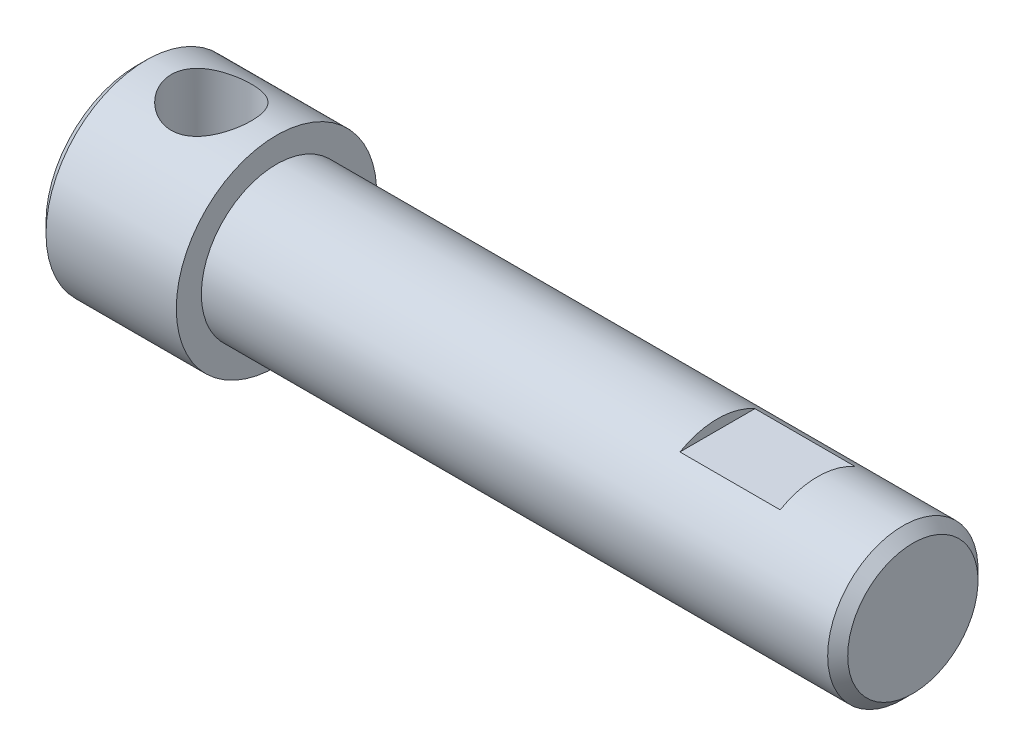
ISO-10303-21;
HEADER;
FILE_DESCRIPTION(('STEP AP214'),'2;1');
FILE_NAME('part.step','',(''),(''),'','','');
FILE_SCHEMA(('AUTOMOTIVE_DESIGN { 1 0 10303 214 1 1 1 1 }'));
ENDSEC;
DATA;
#1=APPLICATION_CONTEXT('core data for automotive mechanical design processes');
#2=APPLICATION_PROTOCOL_DEFINITION('international standard','automotive_design',2000,#1);
#3=PRODUCT_CONTEXT('',#1,'mechanical');
#4=PRODUCT('Part','Part','',(#3));
#5=PRODUCT_RELATED_PRODUCT_CATEGORY('part','',(#4));
#6=PRODUCT_DEFINITION_FORMATION('','',#4);
#7=PRODUCT_DEFINITION_CONTEXT('part definition',#1,'design');
#8=PRODUCT_DEFINITION('design','',#6,#7);
#9=PRODUCT_DEFINITION_SHAPE('','',#8);
#10=(LENGTH_UNIT() NAMED_UNIT(*) SI_UNIT(.MILLI.,.METRE.));
#11=(NAMED_UNIT(*) PLANE_ANGLE_UNIT() SI_UNIT($,.RADIAN.));
#12=(NAMED_UNIT(*) SI_UNIT($,.STERADIAN.) SOLID_ANGLE_UNIT());
#13=UNCERTAINTY_MEASURE_WITH_UNIT(LENGTH_MEASURE(1.E-05),#10,'distance_accuracy_value','');
#14=(GEOMETRIC_REPRESENTATION_CONTEXT(3) GLOBAL_UNCERTAINTY_ASSIGNED_CONTEXT((#13)) GLOBAL_UNIT_ASSIGNED_CONTEXT((#10,
#11,#12)) REPRESENTATION_CONTEXT('',''));
#15=CARTESIAN_POINT('',(0.,0.,0.));
#16=DIRECTION('',(0.,0.,1.));
#17=DIRECTION('',(1.,0.,0.));
#18=AXIS2_PLACEMENT_3D('',#15,#16,#17);
#19=CARTESIAN_POINT('',(-1000.,0.,0.));
#20=DIRECTION('',(-1.,0.,0.));
#21=DIRECTION('',(0.,0.,1.));
#22=AXIS2_PLACEMENT_3D('',#19,#20,#21);
#23=CYLINDRICAL_SURFACE('',#22,7.49999999999999);
#24=CARTESIAN_POINT('',(44.,0.,0.));
#25=DIRECTION('',(-1.,0.,0.));
#26=DIRECTION('',(0.,0.,1.));
#27=AXIS2_PLACEMENT_3D('',#24,#25,#26);
#28=CIRCLE('',#27,7.5);
#29=CARTESIAN_POINT('',(44.,0.,7.5));
#30=VERTEX_POINT('',#29);
#31=EDGE_CURVE('E189',#30,#30,#28,.T.);
#32=ORIENTED_EDGE('',*,*,#31,.T.);
#33=EDGE_LOOP('',(#32));
#34=FACE_BOUND('',#33,.T.);
#35=CARTESIAN_POINT('',(-18.5,0.,0.));
#36=DIRECTION('',(-1.,0.,0.));
#37=DIRECTION('',(0.,0.,1.));
#38=AXIS2_PLACEMENT_3D('',#35,#36,#37);
#39=CIRCLE('',#38,7.49999999999998);
#40=CARTESIAN_POINT('',(-18.5,0.,7.49999999999998));
#41=VERTEX_POINT('',#40);
#42=EDGE_CURVE('E192',#41,#41,#39,.T.);
#43=ORIENTED_EDGE('',*,*,#42,.F.);
#44=EDGE_LOOP('',(#43));
#45=FACE_BOUND('',#44,.T.);
#46=CARTESIAN_POINT('',(25.5000000000001,0.,0.));
#47=DIRECTION('',(1.,0.,0.));
#48=DIRECTION('',(0.,0.,-1.));
#49=AXIS2_PLACEMENT_3D('',#46,#47,#48);
#50=CIRCLE('',#49,7.49999999999999);
#51=CARTESIAN_POINT('',(25.5,6.49999999999999,-3.7416573867741));
#52=VERTEX_POINT('',#51);
#53=CARTESIAN_POINT('',(25.5,6.49999999999999,3.7416573867741));
#54=VERTEX_POINT('',#53);
#55=EDGE_CURVE('E11',#52,#54,#50,.T.);
#56=ORIENTED_EDGE('',*,*,#55,.F.);
#57=DIRECTION('',(-1.,0.,0.));
#58=VECTOR('',#57,1.);
#59=CARTESIAN_POINT('',(-1000.,6.4999999999999,-3.7416573867741));
#60=LINE('',#59,#58);
#61=CARTESIAN_POINT('',(35.5000000000001,6.49999999999999,-3.74165738677394));
#62=VERTEX_POINT('',#61);
#63=EDGE_CURVE('E51',#62,#52,#60,.T.);
#64=ORIENTED_EDGE('',*,*,#63,.F.);
#65=CARTESIAN_POINT('',(35.5000000000001,0.,0.));
#66=DIRECTION('',(-1.,0.,0.));
#67=DIRECTION('',(0.,0.,1.));
#68=AXIS2_PLACEMENT_3D('',#65,#66,#67);
#69=CIRCLE('',#68,7.49999999999999);
#70=CARTESIAN_POINT('',(35.5000000000001,6.49999999999999,3.74165738677394));
#71=VERTEX_POINT('',#70);
#72=EDGE_CURVE('E83',#71,#62,#69,.T.);
#73=ORIENTED_EDGE('',*,*,#72,.F.);
#74=DIRECTION('',(-1.,0.,0.));
#75=VECTOR('',#74,1.);
#76=CARTESIAN_POINT('',(-1000.,6.4999999999999,3.7416573867741));
#77=LINE('',#76,#75);
#78=EDGE_CURVE('E85',#54,#71,#77,.F.);
#79=ORIENTED_EDGE('',*,*,#78,.F.);
#80=EDGE_LOOP('',(#56,#64,#73,#79));
#81=FACE_BOUND('',#80,.T.);
#82=ADVANCED_FACE('F42',(#34,#45,#81),#23,.T.);
#83=CARTESIAN_POINT('',(-1000.,0.,0.));
#84=DIRECTION('',(-1.,0.,0.));
#85=DIRECTION('',(0.,0.,1.));
#86=AXIS2_PLACEMENT_3D('',#83,#84,#85);
#87=CYLINDRICAL_SURFACE('',#86,4.0001510114022);
#88=CARTESIAN_POINT('',(-32.4998489885978,0.,0.));
#89=DIRECTION('',(-1.,0.,0.));
#90=DIRECTION('',(0.,0.,1.));
#91=AXIS2_PLACEMENT_3D('',#88,#89,#90);
#92=CIRCLE('',#91,4.0001510114022);
#93=CARTESIAN_POINT('',(-32.4998489885978,0.,4.0001510114022));
#94=VERTEX_POINT('',#93);
#95=EDGE_CURVE('E210',#94,#94,#92,.T.);
#96=ORIENTED_EDGE('',*,*,#95,.T.);
#97=EDGE_LOOP('',(#96));
#98=FACE_BOUND('',#97,.T.);
#99=CARTESIAN_POINT('',(-15.4998489885978,0.,0.));
#100=DIRECTION('',(-1.,0.,0.));
#101=DIRECTION('',(0.,0.,1.));
#102=AXIS2_PLACEMENT_3D('',#99,#100,#101);
#103=CIRCLE('',#102,4.0001510114022);
#104=CARTESIAN_POINT('',(-15.4998489885978,0.,4.0001510114022));
#105=VERTEX_POINT('',#104);
#106=EDGE_CURVE('E213',#105,#105,#103,.T.);
#107=ORIENTED_EDGE('',*,*,#106,.F.);
#108=EDGE_LOOP('',(#107));
#109=FACE_BOUND('',#108,.T.);
#110=CARTESIAN_POINT('',(-21.716260977791,3.12519999999998,2.49686464871891));
#111=CARTESIAN_POINT('',(-21.7847327549613,3.09419093433794,2.53567339014386));
#112=CARTESIAN_POINT('',(-21.8541710115629,3.06331170356196,2.57284474180386));
#113=CARTESIAN_POINT('',(-21.9948542683633,3.00207301587708,2.64404519989022));
#114=CARTESIAN_POINT('',(-22.0660990718631,2.97171350297849,2.67807464655443));
#115=CARTESIAN_POINT('',(-22.2824463779571,2.88176552715062,2.77569242821243));
#116=CARTESIAN_POINT('',(-22.4300953025771,2.82333812468286,2.8347729211741));
#117=CARTESIAN_POINT('',(-22.7328620203336,2.7112549220461,2.94217374640567));
#118=CARTESIAN_POINT('',(-22.8880399235307,2.6576529260861,2.99038007568749));
#119=CARTESIAN_POINT('',(-23.2038600265188,2.55837789900062,3.07574347120465));
#120=CARTESIAN_POINT('',(-23.3645003009147,2.51270210796726,3.11290438668353));
#121=CARTESIAN_POINT('',(-23.6572428432809,2.44019095741107,3.16991285293393));
#122=CARTESIAN_POINT('',(-23.7884787326784,2.41141297768232,3.19174601131445));
#123=CARTESIAN_POINT('',(-24.0534095129707,2.36189971096617,3.22855915578984));
#124=CARTESIAN_POINT('',(-24.1871039606923,2.34116298908261,3.24354036464432));
#125=CARTESIAN_POINT('',(-24.4554026610943,2.30895293727439,3.26654829027394));
#126=CARTESIAN_POINT('',(-24.5899968241175,2.29742542935393,3.27461570180146));
#127=CARTESIAN_POINT('',(-24.8599098124392,2.28412611073518,3.28390684268224));
#128=CARTESIAN_POINT('',(-24.9952286324247,2.28235422860819,3.28513062214318));
#129=CARTESIAN_POINT('',(-25.2656491656174,2.28868201512875,3.28072500469615));
#130=CARTESIAN_POINT('',(-25.4007505459474,2.29679115681493,3.27508903127873));
#131=CARTESIAN_POINT('',(-25.6695896943846,2.32239297881921,3.25698341109075));
#132=CARTESIAN_POINT('',(-25.8033273998858,2.33988608799395,3.24451345199968));
#133=CARTESIAN_POINT('',(-26.0693474662508,2.38338845191895,3.21269260423838));
#134=CARTESIAN_POINT('',(-26.2016173316553,2.40944527433822,3.19330322839092));
#135=CARTESIAN_POINT('',(-26.4633332080647,2.46876847782559,3.14766381504089));
#136=CARTESIAN_POINT('',(-26.5927786122733,2.50203639163437,3.12141231872784));
#137=CARTESIAN_POINT('',(-26.8604718244319,2.57783395673603,3.05918386458444));
#138=CARTESIAN_POINT('',(-26.9983962144379,2.62094161179469,3.0225225066807));
#139=CARTESIAN_POINT('',(-27.269896699668,2.71242861489574,2.94069763690629));
#140=CARTESIAN_POINT('',(-27.4034726013256,2.76080819719452,2.89553374716341));
#141=CARTESIAN_POINT('',(-27.6645645780461,2.8607411882322,2.79683089446912));
#142=CARTESIAN_POINT('',(-27.7921278091308,2.91225812408656,2.74337996708277));
#143=CARTESIAN_POINT('',(-28.0420075465095,3.01745932256253,2.62721436377265));
#144=CARTESIAN_POINT('',(-28.164324673735,3.07114332722065,2.56450078810657));
#145=CARTESIAN_POINT('',(-28.2837390222091,3.12520000000033,2.49686464871999));
#146=B_SPLINE_CURVE_WITH_KNOTS('',3,(#110,#111,#112,#113,#114,#115,#116,#117,#118,#119,#120,
#121,#122,#123,#124,#125,#126,#127,#128,#129,#130,#131,#132,#133,#134,#135,#136,#137,#138,#139,
#140,#141,#142,#143,#144,#145),.UNSPECIFIED.,.F.,.F.,(4,2,2,2,2,2,2,2,2,2,2,2,2,2,2,2,2,4),(0.,
0.253729999578502,0.507432490352364,1.01508294938191,1.52783088049422,2.04039991274247,
2.44836434223018,2.85625594029335,3.26172985906467,3.66720080903488,4.07306079419025,
4.47893932913055,4.88711155938973,5.29537063319471,5.7421910310699,6.18903129136755,
6.63141430202555,7.07374480670122),.UNSPECIFIED.);
#147=CARTESIAN_POINT('',(-22.0002013590946,2.99999999999998,2.64597961330434));
#148=VERTEX_POINT('',#147);
#149=CARTESIAN_POINT('',(-27.9997986409054,2.99999999999998,2.64597961330434));
#150=VERTEX_POINT('',#149);
#151=EDGE_CURVE('E91',#148,#150,#146,.T.);
#152=ORIENTED_EDGE('',*,*,#151,.F.);
#153=CARTESIAN_POINT('',(-22.0002013590946,2.99999999999998,-2.64597961330434));
#154=CARTESIAN_POINT('',(-21.9411694325751,3.05902796831597,-2.57903915311066));
#155=CARTESIAN_POINT('',(-21.8836975631466,3.11649620977688,-2.50937800447199));
#156=CARTESIAN_POINT('',(-21.7722985047867,3.22788857884901,-2.36438996350875));
#157=CARTESIAN_POINT('',(-21.7183765821946,3.28180744095123,-2.28905499390116));
#158=CARTESIAN_POINT('',(-21.5621023118812,3.4380732161441,-2.05341388886832));
#159=CARTESIAN_POINT('',(-21.4660814096256,3.53408942302234,-1.88440342497134));
#160=CARTESIAN_POINT('',(-21.3109586271195,3.68920505153134,-1.55507150313518));
#161=CARTESIAN_POINT('',(-21.2483634029237,3.75179757370654,-1.39807126855814));
#162=CARTESIAN_POINT('',(-21.1689716639568,3.83118600024917,-1.15350355639645));
#163=CARTESIAN_POINT('',(-21.1449418988764,3.85521478525176,-1.07055976450202));
#164=CARTESIAN_POINT('',(-21.1020710848882,3.89808387596355,-0.902050773966604));
#165=CARTESIAN_POINT('',(-21.0832276424579,3.91692657508604,-0.816486804884299));
#166=CARTESIAN_POINT('',(-21.0509548123309,3.94919814491673,-0.642593339117788));
#167=CARTESIAN_POINT('',(-21.0375705125009,3.96258192964007,-0.554247056065515));
#168=CARTESIAN_POINT('',(-21.0167224093234,3.98342923497946,-0.376203925781674));
#169=CARTESIAN_POINT('',(-21.0092559266338,3.99089543483251,-0.286507708510271));
#170=CARTESIAN_POINT('',(-21.000401056386,3.99974996995749,-0.106453447383064));
#171=CARTESIAN_POINT('',(-20.9990164280286,4.0011345461713,-0.016095028767759));
#172=CARTESIAN_POINT('',(-21.0023577008715,3.99779339961723,0.164365631092451));
#173=CARTESIAN_POINT('',(-21.0070830959388,3.99306818296339,0.25446789293689));
#174=CARTESIAN_POINT('',(-21.0286171461729,3.97153495117461,0.503679611335256));
#175=CARTESIAN_POINT('',(-21.0519794004616,3.94817358857321,0.661741902569762));
#176=CARTESIAN_POINT('',(-21.1162700672351,3.88388545463628,0.970337622984586));
#177=CARTESIAN_POINT('',(-21.1571957865127,3.84296137639309,1.12087220252532));
#178=CARTESIAN_POINT('',(-21.2566600299711,3.74350130582024,1.4189061932267));
#179=CARTESIAN_POINT('',(-21.3159706887848,3.68419321896339,1.56588574990598));
#180=CARTESIAN_POINT('',(-21.4484775705623,3.55169245231091,1.84685378126008));
#181=CARTESIAN_POINT('',(-21.5216906913731,3.47848287585247,1.98082614361334));
#182=CARTESIAN_POINT('',(-21.6612955181047,3.33888534400682,2.20599415242194));
#183=CARTESIAN_POINT('',(-21.7254623990823,3.27472198407561,2.29999618200158));
#184=CARTESIAN_POINT('',(-21.8590841747305,3.14110805727709,2.47932989594683));
#185=CARTESIAN_POINT('',(-21.9285152392917,3.07168131699851,2.56469699703326));
#186=CARTESIAN_POINT('',(-22.0002013590946,2.99999999999998,2.64597961330434));
#187=B_SPLINE_CURVE_WITH_KNOTS('',3,(#153,#154,#155,#156,#157,#158,#159,#160,#161,#162,#163,
#164,#165,#166,#167,#168,#169,#170,#171,#172,#173,#174,#175,#176,#177,#178,#179,#180,#181,#182,
#183,#184,#185,#186),.UNSPECIFIED.,.F.,.F.,(4,2,2,2,2,2,2,2,2,2,2,2,2,2,2,2,4),(0.,
0.320897777962298,0.64226135207762,1.28947488492532,1.82781099766534,2.09642674544064,
2.36491831658656,2.6355845617257,2.9061281902992,3.17683901866971,3.44752742373111,
3.92955899603176,4.4115166793059,4.91735184916096,5.42380582163375,5.81528156840498,
6.20508032521932),.UNSPECIFIED.);
#188=CARTESIAN_POINT('',(-22.0002013590946,2.99999999999998,-2.64597961330434));
#189=VERTEX_POINT('',#188);
#190=EDGE_CURVE('E110',#189,#148,#187,.T.);
#191=ORIENTED_EDGE('',*,*,#190,.F.);
#192=CARTESIAN_POINT('',(-28.2837390222089,3.12519999999998,-2.49686464871891));
#193=CARTESIAN_POINT('',(-28.2152672450386,3.09419093433794,-2.53567339014386));
#194=CARTESIAN_POINT('',(-28.1458289884371,3.06331170356196,-2.57284474180386));
#195=CARTESIAN_POINT('',(-28.0051457316367,3.00207301587708,-2.64404519989022));
#196=CARTESIAN_POINT('',(-27.9339009281368,2.97171350297849,-2.67807464655443));
#197=CARTESIAN_POINT('',(-27.7175536220428,2.88176552715062,-2.77569242821243));
#198=CARTESIAN_POINT('',(-27.5699046974228,2.82333812468286,-2.8347729211741));
#199=CARTESIAN_POINT('',(-27.2671379796663,2.7112549220461,-2.94217374640567));
#200=CARTESIAN_POINT('',(-27.1119600764693,2.6576529260861,-2.99038007568749));
#201=CARTESIAN_POINT('',(-26.7961399734811,2.55837789900062,-3.07574347120465));
#202=CARTESIAN_POINT('',(-26.6354996990852,2.51270210796726,-3.11290438668353));
#203=CARTESIAN_POINT('',(-26.342757156719,2.44019095741107,-3.16991285293393));
#204=CARTESIAN_POINT('',(-26.2115212673215,2.41141297768232,-3.19174601131445));
#205=CARTESIAN_POINT('',(-25.9465904870292,2.36189971096617,-3.22855915578984));
#206=CARTESIAN_POINT('',(-25.8128960393076,2.34116298908261,-3.24354036464432));
#207=CARTESIAN_POINT('',(-25.5445973389056,2.30895293727439,-3.26654829027394));
#208=CARTESIAN_POINT('',(-25.4100031758824,2.29742542935393,-3.27461570180146));
#209=CARTESIAN_POINT('',(-25.1400901875607,2.28412611073518,-3.28390684268224));
#210=CARTESIAN_POINT('',(-25.0047713675752,2.28235422860819,-3.28513062214318));
#211=CARTESIAN_POINT('',(-24.7343508343825,2.28868201512875,-3.28072500469615));
#212=CARTESIAN_POINT('',(-24.5992494540526,2.29679115681493,-3.27508903127873));
#213=CARTESIAN_POINT('',(-24.3304103056154,2.32239297881921,-3.25698341109075));
#214=CARTESIAN_POINT('',(-24.1966726001141,2.33988608799395,-3.24451345199968));
#215=CARTESIAN_POINT('',(-23.9306525337492,2.38338845191895,-3.21269260423838));
#216=CARTESIAN_POINT('',(-23.7983826683447,2.40944527433822,-3.19330322839092));
#217=CARTESIAN_POINT('',(-23.5366667919352,2.46876847782559,-3.14766381504089));
#218=CARTESIAN_POINT('',(-23.4072213877267,2.50203639163437,-3.12141231872784));
#219=CARTESIAN_POINT('',(-23.139528175568,2.57783395673603,-3.05918386458444));
#220=CARTESIAN_POINT('',(-23.001603785562,2.62094161179469,-3.0225225066807));
#221=CARTESIAN_POINT('',(-22.730103300332,2.71242861489574,-2.94069763690629));
#222=CARTESIAN_POINT('',(-22.5965273986744,2.76080819719452,-2.89553374716341));
#223=CARTESIAN_POINT('',(-22.3354354219538,2.8607411882322,-2.79683089446912));
#224=CARTESIAN_POINT('',(-22.2078721908692,2.91225812408656,-2.74337996708277));
#225=CARTESIAN_POINT('',(-21.9579924534904,3.01745932256253,-2.62721436377264));
#226=CARTESIAN_POINT('',(-21.8356753262649,3.07114332722065,-2.56450078810657));
#227=CARTESIAN_POINT('',(-21.7162609777909,3.12520000000033,-2.49686464871999));
#228=B_SPLINE_CURVE_WITH_KNOTS('',3,(#192,#193,#194,#195,#196,#197,#198,#199,#200,#201,#202,
#203,#204,#205,#206,#207,#208,#209,#210,#211,#212,#213,#214,#215,#216,#217,#218,#219,#220,#221,
#222,#223,#224,#225,#226,#227),.UNSPECIFIED.,.F.,.F.,(4,2,2,2,2,2,2,2,2,2,2,2,2,2,2,2,2,4),(0.,
0.253729999578502,0.507432490352364,1.01508294938191,1.52783088049422,2.04039991274247,
2.44836434223018,2.85625594029335,3.26172985906467,3.66720080903488,4.07306079419025,
4.47893932913055,4.88711155938973,5.29537063319471,5.7421910310699,6.18903129136755,
6.63141430202555,7.07374480670122),.UNSPECIFIED.);
#229=CARTESIAN_POINT('',(-27.9997986409054,2.99999999999998,-2.64597961330434));
#230=VERTEX_POINT('',#229);
#231=EDGE_CURVE('E153',#230,#189,#228,.T.);
#232=ORIENTED_EDGE('',*,*,#231,.F.);
#233=CARTESIAN_POINT('',(-27.9997986409054,2.99999999999998,2.64597961330434));
#234=CARTESIAN_POINT('',(-28.0588305674248,3.05902796831597,2.57903915311066));
#235=CARTESIAN_POINT('',(-28.1163024368534,3.11649620977688,2.50937800447199));
#236=CARTESIAN_POINT('',(-28.2277014952132,3.22788857884901,2.36438996350875));
#237=CARTESIAN_POINT('',(-28.2816234178053,3.28180744095123,2.28905499390116));
#238=CARTESIAN_POINT('',(-28.4378976881187,3.4380732161441,2.05341388886832));
#239=CARTESIAN_POINT('',(-28.5339185903743,3.53408942302234,1.88440342497134));
#240=CARTESIAN_POINT('',(-28.6890413728804,3.68920505153134,1.55507150313518));
#241=CARTESIAN_POINT('',(-28.7516365970762,3.75179757370654,1.39807126855814));
#242=CARTESIAN_POINT('',(-28.8310283360431,3.83118600024917,1.15350355639645));
#243=CARTESIAN_POINT('',(-28.8550581011236,3.85521478525176,1.07055976450202));
#244=CARTESIAN_POINT('',(-28.8979289151117,3.89808387596355,0.902050773966604));
#245=CARTESIAN_POINT('',(-28.916772357542,3.91692657508604,0.816486804884299));
#246=CARTESIAN_POINT('',(-28.949045187669,3.94919814491673,0.642593339117788));
#247=CARTESIAN_POINT('',(-28.962429487499,3.96258192964007,0.554247056065515));
#248=CARTESIAN_POINT('',(-28.9832775906765,3.98342923497946,0.376203925781674));
#249=CARTESIAN_POINT('',(-28.9907440733661,3.99089543483251,0.286507708510271));
#250=CARTESIAN_POINT('',(-28.9995989436139,3.99974996995749,0.106453447383064));
#251=CARTESIAN_POINT('',(-29.0009835719714,4.0011345461713,0.016095028767759));
#252=CARTESIAN_POINT('',(-28.9976422991284,3.99779339961723,-0.164365631092451));
#253=CARTESIAN_POINT('',(-28.9929169040612,3.99306818296339,-0.25446789293689));
#254=CARTESIAN_POINT('',(-28.971382853827,3.97153495117461,-0.503679611335256));
#255=CARTESIAN_POINT('',(-28.9480205995383,3.94817358857321,-0.661741902569762));
#256=CARTESIAN_POINT('',(-28.8837299327648,3.88388545463628,-0.970337622984586));
#257=CARTESIAN_POINT('',(-28.8428042134873,3.84296137639309,-1.12087220252532));
#258=CARTESIAN_POINT('',(-28.7433399700288,3.74350130582024,-1.4189061932267));
#259=CARTESIAN_POINT('',(-28.6840293112151,3.68419321896339,-1.56588574990598));
#260=CARTESIAN_POINT('',(-28.5515224294377,3.55169245231091,-1.84685378126008));
#261=CARTESIAN_POINT('',(-28.4783093086269,3.47848287585247,-1.98082614361334));
#262=CARTESIAN_POINT('',(-28.3387044818952,3.33888534400682,-2.20599415242194));
#263=CARTESIAN_POINT('',(-28.2745376009176,3.27472198407561,-2.29999618200158));
#264=CARTESIAN_POINT('',(-28.1409158252695,3.14110805727709,-2.47932989594683));
#265=CARTESIAN_POINT('',(-28.0714847607082,3.07168131699851,-2.56469699703326));
#266=CARTESIAN_POINT('',(-27.9997986409054,2.99999999999998,-2.64597961330434));
#267=B_SPLINE_CURVE_WITH_KNOTS('',3,(#233,#234,#235,#236,#237,#238,#239,#240,#241,#242,#243,
#244,#245,#246,#247,#248,#249,#250,#251,#252,#253,#254,#255,#256,#257,#258,#259,#260,#261,#262,
#263,#264,#265,#266),.UNSPECIFIED.,.F.,.F.,(4,2,2,2,2,2,2,2,2,2,2,2,2,2,2,2,4),(0.,
0.320897777962298,0.64226135207762,1.28947488492532,1.82781099766534,2.09642674544064,
2.36491831658656,2.6355845617257,2.9061281902992,3.17683901866971,3.44752742373111,
3.92955899603176,4.4115166793059,4.91735184916096,5.42380582163375,5.81528156840498,
6.20508032521932),.UNSPECIFIED.);
#268=EDGE_CURVE('E119',#150,#230,#267,.T.);
#269=ORIENTED_EDGE('',*,*,#268,.F.);
#270=EDGE_LOOP('',(#152,#191,#232,#269));
#271=FACE_BOUND('',#270,.T.);
#272=ADVANCED_FACE('F125',(#98,#109,#271),#87,.F.);
#273=CARTESIAN_POINT('',(-1000.,0.,0.));
#274=DIRECTION('',(-1.,0.,0.));
#275=DIRECTION('',(0.,0.,1.));
#276=AXIS2_PLACEMENT_3D('',#273,#274,#275);
#277=CYLINDRICAL_SURFACE('',#276,9.99999999999998);
#278=CARTESIAN_POINT('',(-18.5,0.,0.));
#279=DIRECTION('',(-1.,0.,0.));
#280=DIRECTION('',(0.,0.,1.));
#281=AXIS2_PLACEMENT_3D('',#278,#279,#280);
#282=CIRCLE('',#281,9.99999999999998);
#283=CARTESIAN_POINT('',(-18.5,0.,9.99999999999998));
#284=VERTEX_POINT('',#283);
#285=EDGE_CURVE('E195',#284,#284,#282,.T.);
#286=ORIENTED_EDGE('',*,*,#285,.T.);
#287=EDGE_LOOP('',(#286));
#288=FACE_BOUND('',#287,.T.);
#289=CARTESIAN_POINT('',(-31.5,0.,0.));
#290=DIRECTION('',(-1.,0.,0.));
#291=DIRECTION('',(0.,0.,1.));
#292=AXIS2_PLACEMENT_3D('',#289,#290,#291);
#293=CIRCLE('',#292,9.99999999999998);
#294=CARTESIAN_POINT('',(-31.5,0.,9.99999999999998));
#295=VERTEX_POINT('',#294);
#296=EDGE_CURVE('E200',#295,#295,#293,.T.);
#297=ORIENTED_EDGE('',*,*,#296,.F.);
#298=EDGE_LOOP('',(#297));
#299=FACE_BOUND('',#298,.T.);
#300=CARTESIAN_POINT('',(-29.,9.99999999999998,0.));
#301=CARTESIAN_POINT('',(-28.999998425067,9.99999886871262,0.107549581345537));
#302=CARTESIAN_POINT('',(-28.9956563289198,9.99825999367797,0.215132147940361));
#303=CARTESIAN_POINT('',(-28.978326617216,9.99134740691106,0.429535200549548));
#304=CARTESIAN_POINT('',(-28.9653335465973,9.98617152790585,0.536355162703301));
#305=CARTESIAN_POINT('',(-28.9307919654494,9.97250573560116,0.748635856497416));
#306=CARTESIAN_POINT('',(-28.9092249453801,9.96400865312141,0.854093134440869));
#307=CARTESIAN_POINT('',(-28.8577582695632,9.94393017211572,1.06266761114009));
#308=CARTESIAN_POINT('',(-28.8278552337447,9.93234752254498,1.16578384227259));
#309=CARTESIAN_POINT('',(-28.726277191284,9.89349112162202,1.46979509681069));
#310=CARTESIAN_POINT('',(-28.6425781809936,9.86204458846132,1.66629107461992));
#311=CARTESIAN_POINT('',(-28.4459537826502,9.79113035538706,2.04217417878101));
#312=CARTESIAN_POINT('',(-28.3330385398851,9.7516654408626,2.22156721456798));
#313=CARTESIAN_POINT('',(-28.0755312454783,9.66661825353089,2.56699339938209));
#314=CARTESIAN_POINT('',(-27.9297872894244,9.62084608086597,2.73212223266508));
#315=CARTESIAN_POINT('',(-27.6131993908479,9.52921139577229,3.03635232313263));
#316=CARTESIAN_POINT('',(-27.4423432409834,9.48334885017044,3.17544084661153));
#317=CARTESIAN_POINT('',(-27.0711440314337,9.39445587657956,3.42974847409894));
#318=CARTESIAN_POINT('',(-26.8698270739362,9.35164233015932,3.54362978572887));
#319=CARTESIAN_POINT('',(-26.4489271571991,9.27667293288068,3.73550961465234));
#320=CARTESIAN_POINT('',(-26.2293529322586,9.24451202207143,3.81352517485723));
#321=CARTESIAN_POINT('',(-25.7885753443142,9.19652715590087,3.92779760260541));
#322=CARTESIAN_POINT('',(-25.5678975319118,9.18002840771382,3.96578791979826));
#323=CARTESIAN_POINT('',(-25.1227300003226,9.1632800803814,4.00434593508728));
#324=CARTESIAN_POINT('',(-24.8982422099889,9.163022510732,4.00493203570086));
#325=CARTESIAN_POINT('',(-24.4684866577768,9.17821000534299,3.9699787321474));
#326=CARTESIAN_POINT('',(-24.2629685712343,9.19256349925664,3.93695062778272));
#327=CARTESIAN_POINT('',(-23.8606808876496,9.23352375055551,3.83989376129508));
#328=CARTESIAN_POINT('',(-23.6639128236937,9.26013264599919,3.77585958980135));
#329=CARTESIAN_POINT('',(-23.279964327708,9.32318970221159,3.6173894649114));
#330=CARTESIAN_POINT('',(-23.0930615219175,9.35982758573421,3.52235972457939));
#331=CARTESIAN_POINT('',(-22.7371683672499,9.43876232767924,3.30501292151569));
#332=CARTESIAN_POINT('',(-22.5681847811869,9.48106130910409,3.1826856102159));
#333=CARTESIAN_POINT('',(-22.239180542404,9.57053473488079,2.90310119889356));
#334=CARTESIAN_POINT('',(-22.0808625411101,9.6178332995325,2.74387492593717));
#335=CARTESIAN_POINT('',(-21.7926310439937,9.70919649915612,2.40062885486449));
#336=CARTESIAN_POINT('',(-21.6627232051788,9.7532604889039,2.21660413066998));
#337=CARTESIAN_POINT('',(-21.4327651051689,9.83429362529356,1.82415530521056));
#338=CARTESIAN_POINT('',(-21.333355437606,9.87110540190897,1.61532098269266));
#339=CARTESIAN_POINT('',(-21.1716642778437,9.93229656657445,1.18204753096606));
#340=CARTESIAN_POINT('',(-21.1093639248851,9.95668226924743,0.957616393699403));
#341=CARTESIAN_POINT('',(-21.0271034091606,9.98912279013836,0.513791775215595));
#342=CARTESIAN_POINT('',(-21.0048550914929,9.99805891667032,0.294886587971145));
#343=CARTESIAN_POINT('',(-20.9965737989427,10.0013695702125,-0.143690619615702));
#344=CARTESIAN_POINT('',(-21.0105314369048,9.99574787164575,-0.363362426448179));
#345=CARTESIAN_POINT('',(-21.0725835051041,9.97115134127509,-0.786865478243651));
#346=CARTESIAN_POINT('',(-21.1191159607025,9.95278782691061,-0.990964983549758));
#347=CARTESIAN_POINT('',(-21.242871416619,9.90518882810981,-1.38827085612275));
#348=CARTESIAN_POINT('',(-21.3200983593352,9.87595194712997,-1.58147582045412));
#349=CARTESIAN_POINT('',(-21.5055698793621,9.80833189541685,-1.95815757162884));
#350=CARTESIAN_POINT('',(-21.6146909440946,9.76969631959845,-2.14115604549353));
#351=CARTESIAN_POINT('',(-21.8598806478029,9.68746729490807,-2.4868871825104));
#352=CARTESIAN_POINT('',(-21.9959600858139,9.6438718621964,-2.64961168158684));
#353=CARTESIAN_POINT('',(-22.3017400259326,9.55290235277179,-2.96144608598878));
#354=CARTESIAN_POINT('',(-22.4730670831408,9.50546882853785,-3.10894786734725));
#355=CARTESIAN_POINT('',(-22.8388801658902,9.41483345830578,-3.37350239509234));
#356=CARTESIAN_POINT('',(-23.0333700001994,9.3716323103924,-3.4905501236659));
#357=CARTESIAN_POINT('',(-23.4429233896733,9.29428599829327,-3.69161500286277));
#358=CARTESIAN_POINT('',(-23.6581680002435,9.26023261821738,-3.77530118531766));
#359=CARTESIAN_POINT('',(-24.1014673016127,9.20647346903734,-3.90459244315908));
#360=CARTESIAN_POINT('',(-24.3295124048418,9.18675711197458,-3.95022562452798));
#361=CARTESIAN_POINT('',(-24.774255809844,9.16543518780387,-3.99943122157417));
#362=CARTESIAN_POINT('',(-24.990589701895,9.1626284266761,-4.0057941177721));
#363=CARTESIAN_POINT('',(-25.4210896927211,9.17229671415007,-3.98360636538274));
#364=CARTESIAN_POINT('',(-25.6352560632824,9.18476982225494,-3.9550601501471));
#365=CARTESIAN_POINT('',(-26.0466644608903,9.22253300486267,-3.86614256488129));
#366=CARTESIAN_POINT('',(-26.2442408462211,9.24729672182967,-3.80707437387706));
#367=CARTESIAN_POINT('',(-26.6267569617897,9.30647993934963,-3.66001151041638));
#368=CARTESIAN_POINT('',(-26.8116931851113,9.34090210615102,-3.5720088493455));
#369=CARTESIAN_POINT('',(-27.1752204107094,9.41797252826468,-3.36374310804133));
#370=CARTESIAN_POINT('',(-27.3528418306883,9.46097893410834,-3.24192140926543));
#371=CARTESIAN_POINT('',(-27.6859821426248,9.54927479921249,-2.97179350239177));
#372=CARTESIAN_POINT('',(-27.8414943472899,9.59456494363939,-2.82347931168581));
#373=CARTESIAN_POINT('',(-28.1364235925306,9.68587647140962,-2.492974124467));
#374=CARTESIAN_POINT('',(-28.2741433839823,9.73175488236391,-2.30921017071955));
#375=CARTESIAN_POINT('',(-28.4560481089375,9.79495027625768,-2.01716584575533));
#376=CARTESIAN_POINT('',(-28.5126070638529,9.81509269692653,-1.91699501972425));
#377=CARTESIAN_POINT('',(-28.6170379954052,9.85294835133017,-1.7118011098248));
#378=CARTESIAN_POINT('',(-28.664913949808,9.87066269647663,-1.60678027559742));
#379=CARTESIAN_POINT('',(-28.7507479846849,9.90285599354908,-1.39454646904328));
#380=CARTESIAN_POINT('',(-28.7888701547471,9.91738778532475,-1.28740777135872));
#381=CARTESIAN_POINT('',(-28.8559213477212,9.94319722915711,-1.06995577523384));
#382=CARTESIAN_POINT('',(-28.8848546573499,9.9544763983758,-0.959643983352623));
#383=CARTESIAN_POINT('',(-28.933174836149,9.97343330649397,-0.73694521585684));
#384=CARTESIAN_POINT('',(-28.9525859116449,9.98112017494333,-0.624564263591285));
#385=CARTESIAN_POINT('',(-28.9817385706662,9.99270031578291,-0.398419132407608));
#386=CARTESIAN_POINT('',(-28.9914870268343,9.99659628445549,-0.284655994966358));
#387=CARTESIAN_POINT('',(-28.9987858955734,9.99951445883955,-0.113830463425495));
#388=CARTESIAN_POINT('',(-29.000000833522,10.0000005987258,-0.0569198512645316));
#389=CARTESIAN_POINT('',(-29.,9.99999999999998,0.));
#390=B_SPLINE_CURVE_WITH_KNOTS('',3,(#300,#301,#302,#303,#304,#305,#306,#307,#308,#309,#310,
#311,#312,#313,#314,#315,#316,#317,#318,#319,#320,#321,#322,#323,#324,#325,#326,#327,#328,#329,
#330,#331,#332,#333,#334,#335,#336,#337,#338,#339,#340,#341,#342,#343,#344,#345,#346,#347,#348,
#349,#350,#351,#352,#353,#354,#355,#356,#357,#358,#359,#360,#361,#362,#363,#364,#365,#366,#367,
#368,#369,#370,#371,#372,#373,#374,#375,#376,#377,#378,#379,#380,#381,#382,#383,#384,#385,#386,
#387,#388,#389),.UNSPECIFIED.,.T.,.F.,(4,2,2,2,2,2,2,2,2,2,2,2,2,2,2,2,2,2,2,2,2,2,2,2,2,2,2,2,
2,2,2,2,2,2,2,2,2,2,2,2,2,2,2,2,4),(0.,0.322603993422155,0.645411604786482,0.968919914471234,
1.29255959093094,1.93701523385824,2.58124739027476,3.25313995292301,3.9253602176033,
4.62749749529941,5.32930078128043,5.99927442509165,6.66891844572483,7.29195888698823,
7.9151080641227,8.55097484497807,9.18708075776541,9.87235930273289,10.5577741757964,
11.2567305822579,11.9553314412776,12.6125760095619,13.2696501904034,13.8972014302891,
14.5248332988777,15.171662586967,15.8187515089811,16.50856181149,17.1984856998767,
17.8950932218183,18.5911857719204,19.2371857868567,19.8831037702627,20.5034786899771,
21.124025035105,21.7801016801356,22.4363763459696,23.1352007896785,23.4851924266232,
23.8350233218042,24.1785111324565,24.52183846562,24.8642884495951,25.2064946871486,
25.3772305569977),.UNSPECIFIED.);
#391=CARTESIAN_POINT('',(-29.,9.99999999999998,0.));
#392=VERTEX_POINT('',#391);
#393=EDGE_CURVE('E144',#392,#392,#390,.T.);
#394=ORIENTED_EDGE('',*,*,#393,.F.);
#395=EDGE_LOOP('',(#394));
#396=FACE_BOUND('',#395,.T.);
#397=ADVANCED_FACE('F161',(#288,#299,#396),#277,.T.);
#398=CARTESIAN_POINT('',(44.9999999999999,0.,0.));
#399=DIRECTION('',(-1.,0.,0.));
#400=DIRECTION('',(0.,0.,1.));
#401=AXIS2_PLACEMENT_3D('',#398,#399,#400);
#402=CONICAL_SURFACE('',#401,6.49999999999999,0.785398163397507);
#403=ORIENTED_EDGE('',*,*,#31,.F.);
#404=EDGE_LOOP('',(#403));
#405=FACE_BOUND('',#404,.T.);
#406=CARTESIAN_POINT('',(44.9999999999999,0.,0.));
#407=DIRECTION('',(-1.,0.,0.));
#408=DIRECTION('',(0.,0.,1.));
#409=AXIS2_PLACEMENT_3D('',#406,#407,#408);
#410=CIRCLE('',#409,6.49999999999999);
#411=CARTESIAN_POINT('',(44.9999999999999,0.,6.49999999999999));
#412=VERTEX_POINT('',#411);
#413=EDGE_CURVE('E154',#412,#412,#410,.T.);
#414=ORIENTED_EDGE('',*,*,#413,.T.);
#415=EDGE_LOOP('',(#414));
#416=FACE_BOUND('',#415,.T.);
#417=ADVANCED_FACE('F44',(#405,#416),#402,.T.);
#418=CARTESIAN_POINT('',(45.,0.,0.));
#419=DIRECTION('',(-1.,0.,0.));
#420=DIRECTION('',(0.,0.,1.));
#421=AXIS2_PLACEMENT_3D('',#418,#419,#420);
#422=PLANE('',#421);
#423=ORIENTED_EDGE('',*,*,#413,.F.);
#424=EDGE_LOOP('',(#423));
#425=FACE_BOUND('',#424,.T.);
#426=ADVANCED_FACE('F177',(#425),#422,.F.);
#427=CARTESIAN_POINT('',(-15.4998489885978,0.,0.));
#428=DIRECTION('',(-1.,0.,0.));
#429=DIRECTION('',(0.,0.,1.));
#430=AXIS2_PLACEMENT_3D('',#427,#428,#429);
#431=CONICAL_SURFACE('',#430,4.0001510114022,1.0471887490649);
#432=CARTESIAN_POINT('',(-13.1903137786523,0.,0.));
#433=VERTEX_POINT('',#432);
#434=VERTEX_LOOP('',#433);
#435=FACE_BOUND('',#434,.T.);
#436=ORIENTED_EDGE('',*,*,#106,.T.);
#437=EDGE_LOOP('',(#436));
#438=FACE_BOUND('',#437,.T.);
#439=ADVANCED_FACE('F172',(#435,#438),#431,.F.);
#440=CARTESIAN_POINT('',(-32.4998489885978,4.0001510114022,0.));
#441=DIRECTION('',(1.,0.,0.));
#442=DIRECTION('',(0.,0.,-1.));
#443=AXIS2_PLACEMENT_3D('',#440,#441,#442);
#444=PLANE('',#443);
#445=ORIENTED_EDGE('',*,*,#95,.F.);
#446=EDGE_LOOP('',(#445));
#447=FACE_BOUND('',#446,.T.);
#448=CARTESIAN_POINT('',(-32.4998489885978,0.,0.));
#449=DIRECTION('',(-1.,0.,0.));
#450=DIRECTION('',(0.,0.,1.));
#451=AXIS2_PLACEMENT_3D('',#448,#449,#450);
#452=CIRCLE('',#451,9.0001510114022);
#453=CARTESIAN_POINT('',(-32.4998489885978,0.,9.0001510114022));
#454=VERTEX_POINT('',#453);
#455=EDGE_CURVE('E206',#454,#454,#452,.T.);
#456=ORIENTED_EDGE('',*,*,#455,.T.);
#457=EDGE_LOOP('',(#456));
#458=FACE_BOUND('',#457,.T.);
#459=ADVANCED_FACE('F169',(#447,#458),#444,.F.);
#460=CARTESIAN_POINT('',(-31.5,0.,0.));
#461=DIRECTION('',(1.,0.,0.));
#462=DIRECTION('',(0.,0.,-1.));
#463=AXIS2_PLACEMENT_3D('',#460,#461,#462);
#464=CONICAL_SURFACE('',#463,9.99999999999998,0.785398163397415);
#465=ORIENTED_EDGE('',*,*,#455,.F.);
#466=EDGE_LOOP('',(#465));
#467=FACE_BOUND('',#466,.T.);
#468=ORIENTED_EDGE('',*,*,#296,.T.);
#469=EDGE_LOOP('',(#468));
#470=FACE_BOUND('',#469,.T.);
#471=ADVANCED_FACE('F167',(#467,#470),#464,.T.);
#472=CARTESIAN_POINT('',(-18.5,9.99999999999998,0.));
#473=DIRECTION('',(-1.,0.,0.));
#474=DIRECTION('',(0.,0.,1.));
#475=AXIS2_PLACEMENT_3D('',#472,#473,#474);
#476=PLANE('',#475);
#477=ORIENTED_EDGE('',*,*,#285,.F.);
#478=EDGE_LOOP('',(#477));
#479=FACE_BOUND('',#478,.T.);
#480=ORIENTED_EDGE('',*,*,#42,.T.);
#481=EDGE_LOOP('',(#480));
#482=FACE_BOUND('',#481,.T.);
#483=ADVANCED_FACE('F166',(#479,#482),#476,.F.);
#484=CARTESIAN_POINT('',(-25.,2.99999999999998,0.));
#485=DIRECTION('',(0.,1.,0.));
#486=DIRECTION('',(0.,0.,1.));
#487=AXIS2_PLACEMENT_3D('',#484,#485,#486);
#488=CONICAL_SURFACE('',#487,4.,0.78539816339745);
#489=ORIENTED_EDGE('',*,*,#151,.T.);
#490=CARTESIAN_POINT('',(-25.,2.99999999999998,0.));
#491=DIRECTION('',(0.,-1.,0.));
#492=DIRECTION('',(0.,0.,-1.));
#493=AXIS2_PLACEMENT_3D('',#490,#491,#492);
#494=CIRCLE('',#493,4.);
#495=EDGE_CURVE('E109',#148,#150,#494,.T.);
#496=ORIENTED_EDGE('',*,*,#495,.F.);
#497=EDGE_LOOP('',(#489,#496));
#498=FACE_BOUND('',#497,.T.);
#499=ADVANCED_FACE('F137',(#498),#488,.F.);
#500=ORIENTED_EDGE('',*,*,#231,.T.);
#501=EDGE_CURVE('E57',#230,#189,#494,.T.);
#502=ORIENTED_EDGE('',*,*,#501,.F.);
#503=EDGE_LOOP('',(#500,#502));
#504=FACE_BOUND('',#503,.T.);
#505=ADVANCED_FACE('F135',(#504),#488,.F.);
#506=CARTESIAN_POINT('',(-25.,1.74999999999998,0.));
#507=DIRECTION('',(0.,-1.,0.));
#508=DIRECTION('',(0.,0.,-1.));
#509=AXIS2_PLACEMENT_3D('',#506,#507,#508);
#510=CYLINDRICAL_SURFACE('',#509,4.);
#511=ORIENTED_EDGE('',*,*,#393,.T.);
#512=EDGE_LOOP('',(#511));
#513=FACE_BOUND('',#512,.T.);
#514=ORIENTED_EDGE('',*,*,#268,.T.);
#515=ORIENTED_EDGE('',*,*,#501,.T.);
#516=ORIENTED_EDGE('',*,*,#190,.T.);
#517=ORIENTED_EDGE('',*,*,#495,.T.);
#518=EDGE_LOOP('',(#514,#515,#516,#517));
#519=FACE_BOUND('',#518,.T.);
#520=ADVANCED_FACE('F129',(#513,#519),#510,.F.);
#521=CARTESIAN_POINT('',(25.5,6.49999999999999,4.));
#522=DIRECTION('',(1.,0.,0.));
#523=DIRECTION('',(0.,0.,-1.));
#524=AXIS2_PLACEMENT_3D('',#521,#522,#523);
#525=PLANE('',#524);
#526=DIRECTION('',(0.,0.,-1.));
#527=VECTOR('',#526,1.);
#528=CARTESIAN_POINT('',(25.5,6.49999999999999,4.));
#529=LINE('',#528,#527);
#530=EDGE_CURVE('E98',#54,#52,#529,.T.);
#531=ORIENTED_EDGE('',*,*,#530,.T.);
#532=ORIENTED_EDGE('',*,*,#55,.T.);
#533=EDGE_LOOP('',(#531,#532));
#534=FACE_BOUND('',#533,.T.);
#535=ADVANCED_FACE('F134',(#534),#525,.T.);
#536=CARTESIAN_POINT('',(35.5,6.49999999999999,4.));
#537=DIRECTION('',(0.,1.,0.));
#538=DIRECTION('',(-1.,0.,0.));
#539=AXIS2_PLACEMENT_3D('',#536,#537,#538);
#540=PLANE('',#539);
#541=ORIENTED_EDGE('',*,*,#63,.T.);
#542=ORIENTED_EDGE('',*,*,#530,.F.);
#543=ORIENTED_EDGE('',*,*,#78,.T.);
#544=DIRECTION('',(0.,0.,-1.));
#545=VECTOR('',#544,1.);
#546=CARTESIAN_POINT('',(35.5,6.49999999999999,4.));
#547=LINE('',#546,#545);
#548=EDGE_CURVE('E96',#71,#62,#547,.T.);
#549=ORIENTED_EDGE('',*,*,#548,.T.);
#550=EDGE_LOOP('',(#541,#542,#543,#549));
#551=FACE_BOUND('',#550,.T.);
#552=ADVANCED_FACE('F95',(#551),#540,.T.);
#553=CARTESIAN_POINT('',(35.5,7.49999999999999,4.));
#554=DIRECTION('',(-1.,0.,0.));
#555=DIRECTION('',(0.,0.,1.));
#556=AXIS2_PLACEMENT_3D('',#553,#554,#555);
#557=PLANE('',#556);
#558=ORIENTED_EDGE('',*,*,#548,.F.);
#559=ORIENTED_EDGE('',*,*,#72,.T.);
#560=EDGE_LOOP('',(#558,#559));
#561=FACE_BOUND('',#560,.T.);
#562=ADVANCED_FACE('F101',(#561),#557,.T.);
#563=CLOSED_SHELL('',(#82,#272,#397,#417,#426,#439,#459,#471,#483,#499,#505,#520,#535,#552,#562));
#564=MANIFOLD_SOLID_BREP('B2',#563);
#565=ADVANCED_BREP_SHAPE_REPRESENTATION('',(#18,#564),#14);
#566=SHAPE_DEFINITION_REPRESENTATION(#9,#565);
ENDSEC;
END-ISO-10303-21;
